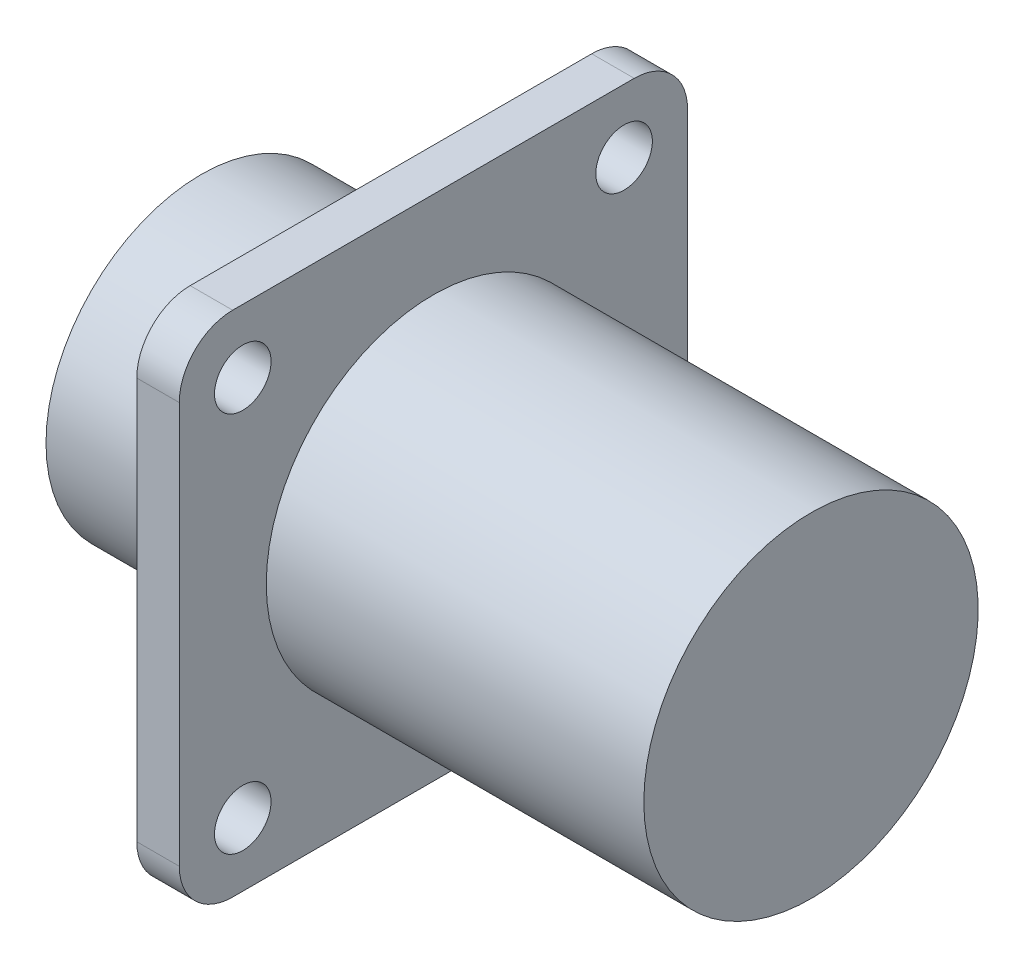
ISO-10303-21;
HEADER;
FILE_DESCRIPTION(('STEP AP214'),'2;1');
FILE_NAME('part.step','',(''),(''),'','','');
FILE_SCHEMA(('AUTOMOTIVE_DESIGN { 1 0 10303 214 1 1 1 1 }'));
ENDSEC;
DATA;
#1=APPLICATION_CONTEXT('core data for automotive mechanical design processes');
#2=APPLICATION_PROTOCOL_DEFINITION('international standard','automotive_design',2000,#1);
#3=PRODUCT_CONTEXT('',#1,'mechanical');
#4=PRODUCT('Part','Part','',(#3));
#5=PRODUCT_RELATED_PRODUCT_CATEGORY('part','',(#4));
#6=PRODUCT_DEFINITION_FORMATION('','',#4);
#7=PRODUCT_DEFINITION_CONTEXT('part definition',#1,'design');
#8=PRODUCT_DEFINITION('design','',#6,#7);
#9=PRODUCT_DEFINITION_SHAPE('','',#8);
#10=(LENGTH_UNIT() NAMED_UNIT(*) SI_UNIT(.MILLI.,.METRE.));
#11=(NAMED_UNIT(*) PLANE_ANGLE_UNIT() SI_UNIT($,.RADIAN.));
#12=(NAMED_UNIT(*) SI_UNIT($,.STERADIAN.) SOLID_ANGLE_UNIT());
#13=UNCERTAINTY_MEASURE_WITH_UNIT(LENGTH_MEASURE(1.E-05),#10,'distance_accuracy_value','');
#14=(GEOMETRIC_REPRESENTATION_CONTEXT(3) GLOBAL_UNCERTAINTY_ASSIGNED_CONTEXT((#13)) GLOBAL_UNIT_ASSIGNED_CONTEXT((#10,
#11,#12)) REPRESENTATION_CONTEXT('',''));
#15=CARTESIAN_POINT('',(0.,0.,0.));
#16=DIRECTION('',(0.,0.,1.));
#17=DIRECTION('',(1.,0.,0.));
#18=AXIS2_PLACEMENT_3D('',#15,#16,#17);
#19=CARTESIAN_POINT('',(10.67,8.725,0.));
#20=DIRECTION('',(1.,0.,0.));
#21=DIRECTION('',(0.,0.,-1.));
#22=AXIS2_PLACEMENT_3D('',#19,#20,#21);
#23=PLANE('',#22);
#24=CARTESIAN_POINT('',(10.67,0.,0.));
#25=DIRECTION('',(-1.,0.,0.));
#26=DIRECTION('',(0.,0.,1.));
#27=AXIS2_PLACEMENT_3D('',#24,#25,#26);
#28=CIRCLE('',#27,8.725);
#29=CARTESIAN_POINT('',(10.67,0.,8.725));
#30=VERTEX_POINT('',#29);
#31=EDGE_CURVE('E166',#30,#30,#28,.T.);
#32=ORIENTED_EDGE('',*,*,#31,.F.);
#33=EDGE_LOOP('',(#32));
#34=FACE_BOUND('',#33,.T.);
#35=CARTESIAN_POINT('',(10.67,10.72,10.72));
#36=DIRECTION('',(-1.,0.,0.));
#37=DIRECTION('',(0.,0.,1.));
#38=AXIS2_PLACEMENT_3D('',#35,#36,#37);
#39=CIRCLE('',#38,1.59);
#40=CARTESIAN_POINT('',(10.67,10.72,12.31));
#41=VERTEX_POINT('',#40);
#42=EDGE_CURVE('E156',#41,#41,#39,.T.);
#43=ORIENTED_EDGE('',*,*,#42,.F.);
#44=EDGE_LOOP('',(#43));
#45=FACE_BOUND('',#44,.T.);
#46=CARTESIAN_POINT('',(10.67,10.72,-10.72));
#47=DIRECTION('',(-1.,0.,0.));
#48=DIRECTION('',(0.,0.,1.));
#49=AXIS2_PLACEMENT_3D('',#46,#47,#48);
#50=CIRCLE('',#49,1.59);
#51=CARTESIAN_POINT('',(10.67,10.72,-9.13));
#52=VERTEX_POINT('',#51);
#53=EDGE_CURVE('E152',#52,#52,#50,.T.);
#54=ORIENTED_EDGE('',*,*,#53,.F.);
#55=EDGE_LOOP('',(#54));
#56=FACE_BOUND('',#55,.T.);
#57=CARTESIAN_POINT('',(10.67,-10.72,-10.72));
#58=DIRECTION('',(-1.,0.,0.));
#59=DIRECTION('',(0.,0.,1.));
#60=AXIS2_PLACEMENT_3D('',#57,#58,#59);
#61=CIRCLE('',#60,1.59);
#62=CARTESIAN_POINT('',(10.67,-10.72,-9.13));
#63=VERTEX_POINT('',#62);
#64=EDGE_CURVE('E148',#63,#63,#61,.T.);
#65=ORIENTED_EDGE('',*,*,#64,.F.);
#66=EDGE_LOOP('',(#65));
#67=FACE_BOUND('',#66,.T.);
#68=CARTESIAN_POINT('',(10.67,-10.72,10.72));
#69=DIRECTION('',(-1.,0.,0.));
#70=DIRECTION('',(0.,0.,1.));
#71=AXIS2_PLACEMENT_3D('',#68,#69,#70);
#72=CIRCLE('',#71,1.59);
#73=CARTESIAN_POINT('',(10.67,-10.72,12.31));
#74=VERTEX_POINT('',#73);
#75=EDGE_CURVE('E135',#74,#74,#72,.T.);
#76=ORIENTED_EDGE('',*,*,#75,.F.);
#77=EDGE_LOOP('',(#76));
#78=FACE_BOUND('',#77,.T.);
#79=CARTESIAN_POINT('',(10.67,-11.29,-11.29));
#80=DIRECTION('',(-1.,0.,0.));
#81=DIRECTION('',(0.,0.,1.));
#82=AXIS2_PLACEMENT_3D('',#79,#80,#81);
#83=CIRCLE('',#82,3.);
#84=CARTESIAN_POINT('',(10.67,-11.29,-14.29));
#85=VERTEX_POINT('',#84);
#86=CARTESIAN_POINT('',(10.67,-14.29,-11.29));
#87=VERTEX_POINT('',#86);
#88=EDGE_CURVE('E119',#85,#87,#83,.T.);
#89=ORIENTED_EDGE('',*,*,#88,.T.);
#90=DIRECTION('',(0.,0.,1.));
#91=VECTOR('',#90,1.);
#92=CARTESIAN_POINT('',(10.67,-14.29,-11.29));
#93=LINE('',#92,#91);
#94=CARTESIAN_POINT('',(10.67,-14.29,11.29));
#95=VERTEX_POINT('',#94);
#96=EDGE_CURVE('E117',#87,#95,#93,.T.);
#97=ORIENTED_EDGE('',*,*,#96,.T.);
#98=CARTESIAN_POINT('',(10.67,-11.29,11.29));
#99=DIRECTION('',(-1.,0.,0.));
#100=DIRECTION('',(0.,0.,1.));
#101=AXIS2_PLACEMENT_3D('',#98,#99,#100);
#102=CIRCLE('',#101,3.);
#103=CARTESIAN_POINT('',(10.67,-11.29,14.29));
#104=VERTEX_POINT('',#103);
#105=EDGE_CURVE('E48',#95,#104,#102,.T.);
#106=ORIENTED_EDGE('',*,*,#105,.T.);
#107=DIRECTION('',(0.,1.,0.));
#108=VECTOR('',#107,1.);
#109=CARTESIAN_POINT('',(10.67,11.29,14.29));
#110=LINE('',#109,#108);
#111=CARTESIAN_POINT('',(10.67,11.29,14.29));
#112=VERTEX_POINT('',#111);
#113=EDGE_CURVE('E107',#104,#112,#110,.T.);
#114=ORIENTED_EDGE('',*,*,#113,.T.);
#115=CARTESIAN_POINT('',(10.67,11.29,11.29));
#116=DIRECTION('',(-1.,0.,0.));
#117=DIRECTION('',(0.,0.,-1.));
#118=AXIS2_PLACEMENT_3D('',#115,#116,#117);
#119=CIRCLE('',#118,3.);
#120=CARTESIAN_POINT('',(10.67,14.29,11.29));
#121=VERTEX_POINT('',#120);
#122=EDGE_CURVE('E113',#112,#121,#119,.T.);
#123=ORIENTED_EDGE('',*,*,#122,.T.);
#124=DIRECTION('',(0.,0.,-1.));
#125=VECTOR('',#124,1.);
#126=CARTESIAN_POINT('',(10.67,14.29,-11.29));
#127=LINE('',#126,#125);
#128=CARTESIAN_POINT('',(10.67,14.29,-11.29));
#129=VERTEX_POINT('',#128);
#130=EDGE_CURVE('E124',#121,#129,#127,.T.);
#131=ORIENTED_EDGE('',*,*,#130,.T.);
#132=CARTESIAN_POINT('',(10.67,11.29,-11.29));
#133=DIRECTION('',(-1.,0.,0.));
#134=DIRECTION('',(0.,0.,1.));
#135=AXIS2_PLACEMENT_3D('',#132,#133,#134);
#136=CIRCLE('',#135,3.);
#137=CARTESIAN_POINT('',(10.67,11.29,-14.29));
#138=VERTEX_POINT('',#137);
#139=EDGE_CURVE('E127',#129,#138,#136,.T.);
#140=ORIENTED_EDGE('',*,*,#139,.T.);
#141=DIRECTION('',(0.,-1.,0.));
#142=VECTOR('',#141,1.);
#143=CARTESIAN_POINT('',(10.67,11.29,-14.29));
#144=LINE('',#143,#142);
#145=EDGE_CURVE('E130',#138,#85,#144,.T.);
#146=ORIENTED_EDGE('',*,*,#145,.T.);
#147=EDGE_LOOP('',(#89,#97,#106,#114,#123,#131,#140,#146));
#148=FACE_BOUND('',#147,.T.);
#149=ADVANCED_FACE('F33',(#34,#45,#56,#67,#78,#148),#23,.F.);
#150=CARTESIAN_POINT('',(13.06,30.,0.));
#151=DIRECTION('',(-1.,0.,0.));
#152=DIRECTION('',(0.,0.,1.));
#153=AXIS2_PLACEMENT_3D('',#150,#151,#152);
#154=PLANE('',#153);
#155=CARTESIAN_POINT('',(13.06,0.,0.));
#156=DIRECTION('',(-1.,0.,0.));
#157=DIRECTION('',(0.,0.,1.));
#158=AXIS2_PLACEMENT_3D('',#155,#156,#157);
#159=CIRCLE('',#158,9.4);
#160=CARTESIAN_POINT('',(13.06,0.,9.4));
#161=VERTEX_POINT('',#160);
#162=EDGE_CURVE('E163',#161,#161,#159,.T.);
#163=ORIENTED_EDGE('',*,*,#162,.T.);
#164=EDGE_LOOP('',(#163));
#165=FACE_BOUND('',#164,.T.);
#166=CARTESIAN_POINT('',(13.06,10.72,10.72));
#167=DIRECTION('',(-1.,0.,0.));
#168=DIRECTION('',(0.,0.,1.));
#169=AXIS2_PLACEMENT_3D('',#166,#167,#168);
#170=CIRCLE('',#169,1.59);
#171=CARTESIAN_POINT('',(13.06,10.72,12.31));
#172=VERTEX_POINT('',#171);
#173=EDGE_CURVE('E159',#172,#172,#170,.T.);
#174=ORIENTED_EDGE('',*,*,#173,.T.);
#175=EDGE_LOOP('',(#174));
#176=FACE_BOUND('',#175,.T.);
#177=CARTESIAN_POINT('',(13.06,10.72,-10.72));
#178=DIRECTION('',(-1.,0.,0.));
#179=DIRECTION('',(0.,0.,1.));
#180=AXIS2_PLACEMENT_3D('',#177,#178,#179);
#181=CIRCLE('',#180,1.59);
#182=CARTESIAN_POINT('',(13.06,10.72,-9.13));
#183=VERTEX_POINT('',#182);
#184=EDGE_CURVE('E155',#183,#183,#181,.T.);
#185=ORIENTED_EDGE('',*,*,#184,.T.);
#186=EDGE_LOOP('',(#185));
#187=FACE_BOUND('',#186,.T.);
#188=CARTESIAN_POINT('',(13.06,-10.72,-10.72));
#189=DIRECTION('',(-1.,0.,0.));
#190=DIRECTION('',(0.,0.,1.));
#191=AXIS2_PLACEMENT_3D('',#188,#189,#190);
#192=CIRCLE('',#191,1.59);
#193=CARTESIAN_POINT('',(13.06,-10.72,-9.13));
#194=VERTEX_POINT('',#193);
#195=EDGE_CURVE('E151',#194,#194,#192,.T.);
#196=ORIENTED_EDGE('',*,*,#195,.T.);
#197=EDGE_LOOP('',(#196));
#198=FACE_BOUND('',#197,.T.);
#199=CARTESIAN_POINT('',(13.06,-10.72,10.72));
#200=DIRECTION('',(-1.,0.,0.));
#201=DIRECTION('',(0.,0.,1.));
#202=AXIS2_PLACEMENT_3D('',#199,#200,#201);
#203=CIRCLE('',#202,1.59);
#204=CARTESIAN_POINT('',(13.06,-10.72,12.31));
#205=VERTEX_POINT('',#204);
#206=EDGE_CURVE('E147',#205,#205,#203,.T.);
#207=ORIENTED_EDGE('',*,*,#206,.T.);
#208=EDGE_LOOP('',(#207));
#209=FACE_BOUND('',#208,.T.);
#210=CARTESIAN_POINT('',(13.06,-11.29,-11.29));
#211=DIRECTION('',(-1.,0.,0.));
#212=DIRECTION('',(0.,0.,1.));
#213=AXIS2_PLACEMENT_3D('',#210,#211,#212);
#214=CIRCLE('',#213,3.);
#215=CARTESIAN_POINT('',(13.06,-11.29,-14.29));
#216=VERTEX_POINT('',#215);
#217=CARTESIAN_POINT('',(13.06,-14.29,-11.29));
#218=VERTEX_POINT('',#217);
#219=EDGE_CURVE('E12',#216,#218,#214,.T.);
#220=ORIENTED_EDGE('',*,*,#219,.F.);
#221=DIRECTION('',(0.,-1.,0.));
#222=VECTOR('',#221,1.);
#223=CARTESIAN_POINT('',(13.06,30.,-14.29));
#224=LINE('',#223,#222);
#225=CARTESIAN_POINT('',(13.06,11.29,-14.29));
#226=VERTEX_POINT('',#225);
#227=EDGE_CURVE('E41',#226,#216,#224,.T.);
#228=ORIENTED_EDGE('',*,*,#227,.F.);
#229=CARTESIAN_POINT('',(13.06,11.29,-11.29));
#230=DIRECTION('',(-1.,0.,0.));
#231=DIRECTION('',(0.,0.,1.));
#232=AXIS2_PLACEMENT_3D('',#229,#230,#231);
#233=CIRCLE('',#232,3.);
#234=CARTESIAN_POINT('',(13.06,14.29,-11.29));
#235=VERTEX_POINT('',#234);
#236=EDGE_CURVE('E189',#235,#226,#233,.T.);
#237=ORIENTED_EDGE('',*,*,#236,.F.);
#238=DIRECTION('',(0.,0.,-1.));
#239=VECTOR('',#238,1.);
#240=CARTESIAN_POINT('',(13.06,14.29,0.));
#241=LINE('',#240,#239);
#242=CARTESIAN_POINT('',(13.06,14.29,11.29));
#243=VERTEX_POINT('',#242);
#244=EDGE_CURVE('E187',#243,#235,#241,.T.);
#245=ORIENTED_EDGE('',*,*,#244,.F.);
#246=CARTESIAN_POINT('',(13.06,11.29,11.29));
#247=DIRECTION('',(-1.,0.,0.));
#248=DIRECTION('',(0.,0.,1.));
#249=AXIS2_PLACEMENT_3D('',#246,#247,#248);
#250=CIRCLE('',#249,3.);
#251=CARTESIAN_POINT('',(13.06,11.29,14.29));
#252=VERTEX_POINT('',#251);
#253=EDGE_CURVE('E185',#252,#243,#250,.T.);
#254=ORIENTED_EDGE('',*,*,#253,.F.);
#255=DIRECTION('',(0.,1.,0.));
#256=VECTOR('',#255,1.);
#257=CARTESIAN_POINT('',(13.06,30.,14.29));
#258=LINE('',#257,#256);
#259=CARTESIAN_POINT('',(13.06,-11.29,14.29));
#260=VERTEX_POINT('',#259);
#261=EDGE_CURVE('E183',#260,#252,#258,.T.);
#262=ORIENTED_EDGE('',*,*,#261,.F.);
#263=CARTESIAN_POINT('',(13.06,-11.29,11.29));
#264=DIRECTION('',(-1.,0.,0.));
#265=DIRECTION('',(0.,0.,1.));
#266=AXIS2_PLACEMENT_3D('',#263,#264,#265);
#267=CIRCLE('',#266,3.);
#268=CARTESIAN_POINT('',(13.06,-14.29,11.29));
#269=VERTEX_POINT('',#268);
#270=EDGE_CURVE('E100',#269,#260,#267,.T.);
#271=ORIENTED_EDGE('',*,*,#270,.F.);
#272=DIRECTION('',(0.,0.,1.));
#273=VECTOR('',#272,1.);
#274=CARTESIAN_POINT('',(13.06,-14.29,0.));
#275=LINE('',#274,#273);
#276=EDGE_CURVE('E172',#218,#269,#275,.T.);
#277=ORIENTED_EDGE('',*,*,#276,.F.);
#278=EDGE_LOOP('',(#220,#228,#237,#245,#254,#262,#271,#277));
#279=FACE_BOUND('',#278,.T.);
#280=ADVANCED_FACE('F203',(#165,#176,#187,#198,#209,#279),#154,.F.);
#281=CARTESIAN_POINT('',(0.,0.,0.));
#282=DIRECTION('',(1.,0.,0.));
#283=DIRECTION('',(0.,0.,-1.));
#284=AXIS2_PLACEMENT_3D('',#281,#282,#283);
#285=PLANE('',#284);
#286=CARTESIAN_POINT('',(0.,0.,0.));
#287=DIRECTION('',(-1.,0.,0.));
#288=DIRECTION('',(0.,0.,1.));
#289=AXIS2_PLACEMENT_3D('',#286,#287,#288);
#290=CIRCLE('',#289,8.725);
#291=CARTESIAN_POINT('',(0.,0.,8.725));
#292=VERTEX_POINT('',#291);
#293=EDGE_CURVE('E169',#292,#292,#290,.T.);
#294=ORIENTED_EDGE('',*,*,#293,.T.);
#295=EDGE_LOOP('',(#294));
#296=FACE_BOUND('',#295,.T.);
#297=ADVANCED_FACE('F35',(#296),#285,.F.);
#298=CARTESIAN_POINT('',(0.,0.,0.));
#299=DIRECTION('',(-1.,0.,0.));
#300=DIRECTION('',(0.,0.,1.));
#301=AXIS2_PLACEMENT_3D('',#298,#299,#300);
#302=CYLINDRICAL_SURFACE('',#301,8.725);
#303=ORIENTED_EDGE('',*,*,#293,.F.);
#304=EDGE_LOOP('',(#303));
#305=FACE_BOUND('',#304,.T.);
#306=ORIENTED_EDGE('',*,*,#31,.T.);
#307=EDGE_LOOP('',(#306));
#308=FACE_BOUND('',#307,.T.);
#309=ADVANCED_FACE('F236',(#305,#308),#302,.T.);
#310=CARTESIAN_POINT('',(0.,0.,0.));
#311=DIRECTION('',(-1.,0.,0.));
#312=DIRECTION('',(0.,0.,1.));
#313=AXIS2_PLACEMENT_3D('',#310,#311,#312);
#314=CYLINDRICAL_SURFACE('',#313,9.4);
#315=ORIENTED_EDGE('',*,*,#162,.F.);
#316=EDGE_LOOP('',(#315));
#317=FACE_BOUND('',#316,.T.);
#318=CARTESIAN_POINT('',(34.29,0.,0.));
#319=DIRECTION('',(-1.,0.,0.));
#320=DIRECTION('',(0.,0.,1.));
#321=AXIS2_PLACEMENT_3D('',#318,#319,#320);
#322=CIRCLE('',#321,9.4);
#323=CARTESIAN_POINT('',(34.29,0.,9.4));
#324=VERTEX_POINT('',#323);
#325=EDGE_CURVE('E160',#324,#324,#322,.T.);
#326=ORIENTED_EDGE('',*,*,#325,.T.);
#327=EDGE_LOOP('',(#326));
#328=FACE_BOUND('',#327,.T.);
#329=ADVANCED_FACE('F238',(#317,#328),#314,.T.);
#330=CARTESIAN_POINT('',(34.29,9.4,0.));
#331=DIRECTION('',(-1.,0.,0.));
#332=DIRECTION('',(0.,0.,1.));
#333=AXIS2_PLACEMENT_3D('',#330,#331,#332);
#334=PLANE('',#333);
#335=ORIENTED_EDGE('',*,*,#325,.F.);
#336=EDGE_LOOP('',(#335));
#337=FACE_BOUND('',#336,.T.);
#338=ADVANCED_FACE('F244',(#337),#334,.F.);
#339=CARTESIAN_POINT('',(34.29,10.72,10.72));
#340=DIRECTION('',(-1.,0.,0.));
#341=DIRECTION('',(0.,0.,1.));
#342=AXIS2_PLACEMENT_3D('',#339,#340,#341);
#343=CYLINDRICAL_SURFACE('',#342,1.59);
#344=ORIENTED_EDGE('',*,*,#42,.T.);
#345=EDGE_LOOP('',(#344));
#346=FACE_BOUND('',#345,.T.);
#347=ORIENTED_EDGE('',*,*,#173,.F.);
#348=EDGE_LOOP('',(#347));
#349=FACE_BOUND('',#348,.T.);
#350=ADVANCED_FACE('F264',(#346,#349),#343,.F.);
#351=CARTESIAN_POINT('',(34.29,10.72,-10.72));
#352=DIRECTION('',(-1.,0.,0.));
#353=DIRECTION('',(0.,0.,1.));
#354=AXIS2_PLACEMENT_3D('',#351,#352,#353);
#355=CYLINDRICAL_SURFACE('',#354,1.59);
#356=ORIENTED_EDGE('',*,*,#53,.T.);
#357=EDGE_LOOP('',(#356));
#358=FACE_BOUND('',#357,.T.);
#359=ORIENTED_EDGE('',*,*,#184,.F.);
#360=EDGE_LOOP('',(#359));
#361=FACE_BOUND('',#360,.T.);
#362=ADVANCED_FACE('F269',(#358,#361),#355,.F.);
#363=CARTESIAN_POINT('',(34.29,-10.72,-10.72));
#364=DIRECTION('',(-1.,0.,0.));
#365=DIRECTION('',(0.,0.,1.));
#366=AXIS2_PLACEMENT_3D('',#363,#364,#365);
#367=CYLINDRICAL_SURFACE('',#366,1.59);
#368=ORIENTED_EDGE('',*,*,#64,.T.);
#369=EDGE_LOOP('',(#368));
#370=FACE_BOUND('',#369,.T.);
#371=ORIENTED_EDGE('',*,*,#195,.F.);
#372=EDGE_LOOP('',(#371));
#373=FACE_BOUND('',#372,.T.);
#374=ADVANCED_FACE('F280',(#370,#373),#367,.F.);
#375=CARTESIAN_POINT('',(34.29,-10.72,10.72));
#376=DIRECTION('',(-1.,0.,0.));
#377=DIRECTION('',(0.,0.,1.));
#378=AXIS2_PLACEMENT_3D('',#375,#376,#377);
#379=CYLINDRICAL_SURFACE('',#378,1.59);
#380=ORIENTED_EDGE('',*,*,#75,.T.);
#381=EDGE_LOOP('',(#380));
#382=FACE_BOUND('',#381,.T.);
#383=ORIENTED_EDGE('',*,*,#206,.F.);
#384=EDGE_LOOP('',(#383));
#385=FACE_BOUND('',#384,.T.);
#386=ADVANCED_FACE('F290',(#382,#385),#379,.F.);
#387=CARTESIAN_POINT('',(34.29,-11.29,-11.29));
#388=DIRECTION('',(-1.,0.,0.));
#389=DIRECTION('',(0.,0.,1.));
#390=AXIS2_PLACEMENT_3D('',#387,#388,#389);
#391=CYLINDRICAL_SURFACE('',#390,3.);
#392=ORIENTED_EDGE('',*,*,#219,.T.);
#393=DIRECTION('',(-1.,0.,0.));
#394=VECTOR('',#393,1.);
#395=CARTESIAN_POINT('',(34.29,-14.29,-11.29));
#396=LINE('',#395,#394);
#397=EDGE_CURVE('E56',#218,#87,#396,.T.);
#398=ORIENTED_EDGE('',*,*,#397,.T.);
#399=ORIENTED_EDGE('',*,*,#88,.F.);
#400=DIRECTION('',(-1.,0.,0.));
#401=VECTOR('',#400,1.);
#402=CARTESIAN_POINT('',(34.29,-11.29,-14.29));
#403=LINE('',#402,#401);
#404=EDGE_CURVE('E133',#216,#85,#403,.T.);
#405=ORIENTED_EDGE('',*,*,#404,.F.);
#406=EDGE_LOOP('',(#392,#398,#399,#405));
#407=FACE_BOUND('',#406,.T.);
#408=ADVANCED_FACE('F201',(#407),#391,.T.);
#409=CARTESIAN_POINT('',(34.29,11.29,-14.29));
#410=DIRECTION('',(0.,0.,-1.));
#411=DIRECTION('',(0.,1.,0.));
#412=AXIS2_PLACEMENT_3D('',#409,#410,#411);
#413=PLANE('',#412);
#414=ORIENTED_EDGE('',*,*,#227,.T.);
#415=ORIENTED_EDGE('',*,*,#404,.T.);
#416=ORIENTED_EDGE('',*,*,#145,.F.);
#417=DIRECTION('',(-1.,0.,0.));
#418=VECTOR('',#417,1.);
#419=CARTESIAN_POINT('',(34.29,11.29,-14.29));
#420=LINE('',#419,#418);
#421=EDGE_CURVE('E136',#226,#138,#420,.T.);
#422=ORIENTED_EDGE('',*,*,#421,.F.);
#423=EDGE_LOOP('',(#414,#415,#416,#422));
#424=FACE_BOUND('',#423,.T.);
#425=ADVANCED_FACE('F194',(#424),#413,.T.);
#426=CARTESIAN_POINT('',(34.29,11.29,-11.29));
#427=DIRECTION('',(-1.,0.,0.));
#428=DIRECTION('',(0.,0.,1.));
#429=AXIS2_PLACEMENT_3D('',#426,#427,#428);
#430=CYLINDRICAL_SURFACE('',#429,3.);
#431=ORIENTED_EDGE('',*,*,#236,.T.);
#432=ORIENTED_EDGE('',*,*,#421,.T.);
#433=ORIENTED_EDGE('',*,*,#139,.F.);
#434=DIRECTION('',(-1.,0.,0.));
#435=VECTOR('',#434,1.);
#436=CARTESIAN_POINT('',(34.29,14.29,-11.29));
#437=LINE('',#436,#435);
#438=EDGE_CURVE('E138',#235,#129,#437,.T.);
#439=ORIENTED_EDGE('',*,*,#438,.F.);
#440=EDGE_LOOP('',(#431,#432,#433,#439));
#441=FACE_BOUND('',#440,.T.);
#442=ADVANCED_FACE('F209',(#441),#430,.T.);
#443=CARTESIAN_POINT('',(34.29,14.29,-11.29));
#444=DIRECTION('',(0.,1.,0.));
#445=DIRECTION('',(0.,0.,1.));
#446=AXIS2_PLACEMENT_3D('',#443,#444,#445);
#447=PLANE('',#446);
#448=ORIENTED_EDGE('',*,*,#244,.T.);
#449=ORIENTED_EDGE('',*,*,#438,.T.);
#450=ORIENTED_EDGE('',*,*,#130,.F.);
#451=DIRECTION('',(-1.,0.,0.));
#452=VECTOR('',#451,1.);
#453=CARTESIAN_POINT('',(34.29,14.29,11.29));
#454=LINE('',#453,#452);
#455=EDGE_CURVE('E140',#243,#121,#454,.T.);
#456=ORIENTED_EDGE('',*,*,#455,.F.);
#457=EDGE_LOOP('',(#448,#449,#450,#456));
#458=FACE_BOUND('',#457,.T.);
#459=ADVANCED_FACE('F214',(#458),#447,.T.);
#460=CARTESIAN_POINT('',(34.29,11.29,11.29));
#461=DIRECTION('',(-1.,0.,0.));
#462=DIRECTION('',(0.,0.,1.));
#463=AXIS2_PLACEMENT_3D('',#460,#461,#462);
#464=CYLINDRICAL_SURFACE('',#463,3.);
#465=ORIENTED_EDGE('',*,*,#253,.T.);
#466=ORIENTED_EDGE('',*,*,#455,.T.);
#467=ORIENTED_EDGE('',*,*,#122,.F.);
#468=DIRECTION('',(-1.,0.,0.));
#469=VECTOR('',#468,1.);
#470=CARTESIAN_POINT('',(34.29,11.29,14.29));
#471=LINE('',#470,#469);
#472=EDGE_CURVE('E103',#252,#112,#471,.T.);
#473=ORIENTED_EDGE('',*,*,#472,.F.);
#474=EDGE_LOOP('',(#465,#466,#467,#473));
#475=FACE_BOUND('',#474,.T.);
#476=ADVANCED_FACE('F216',(#475),#464,.T.);
#477=CARTESIAN_POINT('',(34.29,11.29,14.29));
#478=DIRECTION('',(0.,0.,1.));
#479=DIRECTION('',(1.,0.,0.));
#480=AXIS2_PLACEMENT_3D('',#477,#478,#479);
#481=PLANE('',#480);
#482=ORIENTED_EDGE('',*,*,#261,.T.);
#483=ORIENTED_EDGE('',*,*,#472,.T.);
#484=ORIENTED_EDGE('',*,*,#113,.F.);
#485=DIRECTION('',(-1.,0.,0.));
#486=VECTOR('',#485,1.);
#487=CARTESIAN_POINT('',(34.29,-11.29,14.29));
#488=LINE('',#487,#486);
#489=EDGE_CURVE('E96',#260,#104,#488,.T.);
#490=ORIENTED_EDGE('',*,*,#489,.F.);
#491=EDGE_LOOP('',(#482,#483,#484,#490));
#492=FACE_BOUND('',#491,.T.);
#493=ADVANCED_FACE('F108',(#492),#481,.T.);
#494=CARTESIAN_POINT('',(34.29,-11.29,11.29));
#495=DIRECTION('',(-1.,0.,0.));
#496=DIRECTION('',(0.,0.,1.));
#497=AXIS2_PLACEMENT_3D('',#494,#495,#496);
#498=CYLINDRICAL_SURFACE('',#497,3.);
#499=ORIENTED_EDGE('',*,*,#270,.T.);
#500=ORIENTED_EDGE('',*,*,#489,.T.);
#501=ORIENTED_EDGE('',*,*,#105,.F.);
#502=DIRECTION('',(-1.,0.,0.));
#503=VECTOR('',#502,1.);
#504=CARTESIAN_POINT('',(34.29,-14.29,11.29));
#505=LINE('',#504,#503);
#506=EDGE_CURVE('E104',#269,#95,#505,.T.);
#507=ORIENTED_EDGE('',*,*,#506,.F.);
#508=EDGE_LOOP('',(#499,#500,#501,#507));
#509=FACE_BOUND('',#508,.T.);
#510=ADVANCED_FACE('F98',(#509),#498,.T.);
#511=CARTESIAN_POINT('',(34.29,-14.29,-11.29));
#512=DIRECTION('',(0.,-1.,0.));
#513=DIRECTION('',(0.,0.,-1.));
#514=AXIS2_PLACEMENT_3D('',#511,#512,#513);
#515=PLANE('',#514);
#516=ORIENTED_EDGE('',*,*,#276,.T.);
#517=ORIENTED_EDGE('',*,*,#506,.T.);
#518=ORIENTED_EDGE('',*,*,#96,.F.);
#519=ORIENTED_EDGE('',*,*,#397,.F.);
#520=EDGE_LOOP('',(#516,#517,#518,#519));
#521=FACE_BOUND('',#520,.T.);
#522=ADVANCED_FACE('F204',(#521),#515,.T.);
#523=CLOSED_SHELL('',(#149,#280,#297,#309,#329,#338,#350,#362,#374,#386,#408,#425,#442,#459,
#476,#493,#510,#522));
#524=MANIFOLD_SOLID_BREP('B2',#523);
#525=ADVANCED_BREP_SHAPE_REPRESENTATION('',(#18,#524),#14);
#526=SHAPE_DEFINITION_REPRESENTATION(#9,#525);
ENDSEC;
END-ISO-10303-21;
